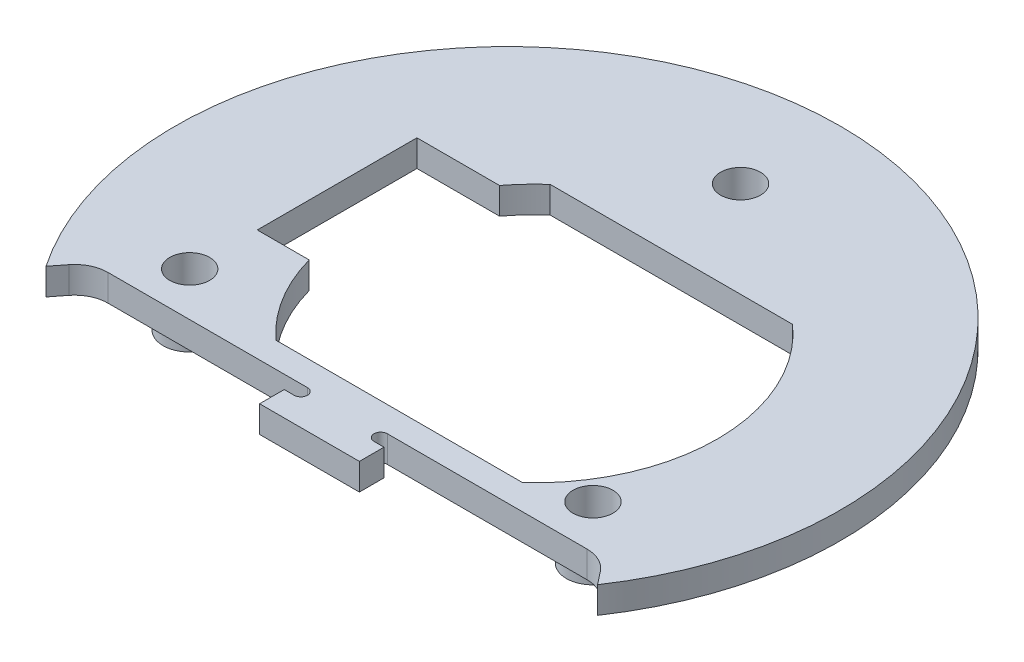
ISO-10303-21;
HEADER;
FILE_DESCRIPTION(('STEP AP214'),'2;1');
FILE_NAME('part.step','',(''),(''),'','','');
FILE_SCHEMA(('AUTOMOTIVE_DESIGN { 1 0 10303 214 1 1 1 1 }'));
ENDSEC;
DATA;
#1=APPLICATION_CONTEXT('core data for automotive mechanical design processes');
#2=APPLICATION_PROTOCOL_DEFINITION('international standard','automotive_design',2000,#1);
#3=PRODUCT_CONTEXT('',#1,'mechanical');
#4=PRODUCT('Part','Part','',(#3));
#5=PRODUCT_RELATED_PRODUCT_CATEGORY('part','',(#4));
#6=PRODUCT_DEFINITION_FORMATION('','',#4);
#7=PRODUCT_DEFINITION_CONTEXT('part definition',#1,'design');
#8=PRODUCT_DEFINITION('design','',#6,#7);
#9=PRODUCT_DEFINITION_SHAPE('','',#8);
#10=(LENGTH_UNIT() NAMED_UNIT(*) SI_UNIT(.MILLI.,.METRE.));
#11=(NAMED_UNIT(*) PLANE_ANGLE_UNIT() SI_UNIT($,.RADIAN.));
#12=(NAMED_UNIT(*) SI_UNIT($,.STERADIAN.) SOLID_ANGLE_UNIT());
#13=UNCERTAINTY_MEASURE_WITH_UNIT(LENGTH_MEASURE(1.E-05),#10,'distance_accuracy_value','');
#14=(GEOMETRIC_REPRESENTATION_CONTEXT(3) GLOBAL_UNCERTAINTY_ASSIGNED_CONTEXT((#13)) GLOBAL_UNIT_ASSIGNED_CONTEXT((#10,
#11,#12)) REPRESENTATION_CONTEXT('',''));
#15=CARTESIAN_POINT('',(0.,0.,0.));
#16=DIRECTION('',(0.,0.,1.));
#17=DIRECTION('',(1.,0.,0.));
#18=AXIS2_PLACEMENT_3D('',#15,#16,#17);
#19=CARTESIAN_POINT('',(0.,4.,0.));
#20=DIRECTION('',(0.,-1.,0.));
#21=DIRECTION('',(0.,0.,-1.));
#22=AXIS2_PLACEMENT_3D('',#19,#20,#21);
#23=CYLINDRICAL_SURFACE('',#22,50.);
#24=DIRECTION('',(0.,-1.,0.));
#25=VECTOR('',#24,1.);
#26=CARTESIAN_POINT('',(-41.4552503209535,4.,27.9546457825364));
#27=LINE('',#26,#25);
#28=CARTESIAN_POINT('',(-41.4552503209535,4.,27.9546457825364));
#29=VERTEX_POINT('',#28);
#30=CARTESIAN_POINT('',(-41.4552503209535,0.,27.9546457825364));
#31=VERTEX_POINT('',#30);
#32=EDGE_CURVE('E321',#29,#31,#27,.T.);
#33=ORIENTED_EDGE('',*,*,#32,.F.);
#34=CARTESIAN_POINT('',(0.,4.,0.));
#35=DIRECTION('',(0.,1.,0.));
#36=DIRECTION('',(0.,0.,1.));
#37=AXIS2_PLACEMENT_3D('',#34,#35,#36);
#38=CIRCLE('',#37,50.);
#39=CARTESIAN_POINT('',(41.4552503209535,4.,27.9546457825364));
#40=VERTEX_POINT('',#39);
#41=EDGE_CURVE('E354',#40,#29,#38,.T.);
#42=ORIENTED_EDGE('',*,*,#41,.F.);
#43=DIRECTION('',(0.,-1.,0.));
#44=VECTOR('',#43,1.);
#45=CARTESIAN_POINT('',(41.4552503209535,4.,27.9546457825364));
#46=LINE('',#45,#44);
#47=CARTESIAN_POINT('',(41.4552503209535,0.,27.9546457825364));
#48=VERTEX_POINT('',#47);
#49=EDGE_CURVE('E318',#40,#48,#46,.T.);
#50=ORIENTED_EDGE('',*,*,#49,.T.);
#51=CARTESIAN_POINT('',(0.,0.,0.));
#52=DIRECTION('',(0.,1.,0.));
#53=DIRECTION('',(0.,0.,1.));
#54=AXIS2_PLACEMENT_3D('',#51,#52,#53);
#55=CIRCLE('',#54,50.);
#56=EDGE_CURVE('E353',#48,#31,#55,.T.);
#57=ORIENTED_EDGE('',*,*,#56,.T.);
#58=EDGE_LOOP('',(#33,#42,#50,#57));
#59=FACE_BOUND('',#58,.T.);
#60=ADVANCED_FACE('F34',(#59),#23,.T.);
#61=CARTESIAN_POINT('',(0.,4.,0.));
#62=DIRECTION('',(0.,1.,0.));
#63=DIRECTION('',(0.,0.,1.));
#64=AXIS2_PLACEMENT_3D('',#61,#62,#63);
#65=PLANE('',#64);
#66=DIRECTION('',(1.,0.,0.));
#67=VECTOR('',#66,1.);
#68=CARTESIAN_POINT('',(0.,4.,7.35));
#69=LINE('',#68,#67);
#70=CARTESIAN_POINT('',(-30.3,4.,7.35));
#71=VERTEX_POINT('',#70);
#72=CARTESIAN_POINT('',(-22.4995754682976,4.,7.35));
#73=VERTEX_POINT('',#72);
#74=EDGE_CURVE('E48',#71,#73,#69,.T.);
#75=ORIENTED_EDGE('',*,*,#74,.F.);
#76=DIRECTION('',(0.,0.,-1.));
#77=VECTOR('',#76,1.);
#78=CARTESIAN_POINT('',(-30.3,4.,0.));
#79=LINE('',#78,#77);
#80=CARTESIAN_POINT('',(-30.3,4.,-16.65));
#81=VERTEX_POINT('',#80);
#82=EDGE_CURVE('E215',#71,#81,#79,.T.);
#83=ORIENTED_EDGE('',*,*,#82,.T.);
#84=DIRECTION('',(1.,0.,0.));
#85=VECTOR('',#84,1.);
#86=CARTESIAN_POINT('',(0.,4.,-16.65));
#87=LINE('',#86,#85);
#88=CARTESIAN_POINT('',(-17.8866968727581,4.,-16.65));
#89=VERTEX_POINT('',#88);
#90=EDGE_CURVE('E212',#81,#89,#87,.T.);
#91=ORIENTED_EDGE('',*,*,#90,.T.);
#92=CARTESIAN_POINT('',(4.,4.,0.));
#93=DIRECTION('',(0.,1.,0.));
#94=DIRECTION('',(0.,0.,1.));
#95=AXIS2_PLACEMENT_3D('',#92,#93,#94);
#96=CIRCLE('',#95,27.5);
#97=CARTESIAN_POINT('',(-14.2178483910697,4.,-20.6));
#98=VERTEX_POINT('',#97);
#99=EDGE_CURVE('E209',#98,#89,#96,.T.);
#100=ORIENTED_EDGE('',*,*,#99,.F.);
#101=DIRECTION('',(1.,0.,0.));
#102=VECTOR('',#101,1.);
#103=CARTESIAN_POINT('',(0.,4.,-20.6));
#104=LINE('',#103,#102);
#105=CARTESIAN_POINT('',(22.2178483910697,4.,-20.6));
#106=VERTEX_POINT('',#105);
#107=EDGE_CURVE('E204',#98,#106,#104,.T.);
#108=ORIENTED_EDGE('',*,*,#107,.T.);
#109=CARTESIAN_POINT('',(4.,4.,0.));
#110=DIRECTION('',(0.,1.,0.));
#111=DIRECTION('',(0.,0.,1.));
#112=AXIS2_PLACEMENT_3D('',#109,#110,#111);
#113=CIRCLE('',#112,27.5);
#114=CARTESIAN_POINT('',(22.5515498004884,4.,20.3));
#115=VERTEX_POINT('',#114);
#116=EDGE_CURVE('E202',#115,#106,#113,.T.);
#117=ORIENTED_EDGE('',*,*,#116,.F.);
#118=DIRECTION('',(-1.,0.,0.));
#119=VECTOR('',#118,1.);
#120=CARTESIAN_POINT('',(0.,4.,20.3));
#121=LINE('',#120,#119);
#122=CARTESIAN_POINT('',(-14.5515498004884,4.,20.3));
#123=VERTEX_POINT('',#122);
#124=EDGE_CURVE('E185',#115,#123,#121,.T.);
#125=ORIENTED_EDGE('',*,*,#124,.T.);
#126=CARTESIAN_POINT('',(4.,4.,0.));
#127=DIRECTION('',(0.,1.,0.));
#128=DIRECTION('',(0.,0.,1.));
#129=AXIS2_PLACEMENT_3D('',#126,#127,#128);
#130=CIRCLE('',#129,27.5);
#131=EDGE_CURVE('E194',#73,#123,#130,.T.);
#132=ORIENTED_EDGE('',*,*,#131,.F.);
#133=EDGE_LOOP('',(#75,#83,#91,#100,#108,#117,#125,#132));
#134=FACE_BOUND('',#133,.T.);
#135=CARTESIAN_POINT('',(30.3108891324553,4.,17.5000000000001));
#136=DIRECTION('',(0.,1.,0.));
#137=DIRECTION('',(-0.866025403784436,0.,-0.500000000000004));
#138=AXIS2_PLACEMENT_3D('',#135,#136,#137);
#139=CIRCLE('',#138,3.);
#140=CARTESIAN_POINT('',(27.712812921102,4.,16.0000000000001));
#141=VERTEX_POINT('',#140);
#142=EDGE_CURVE('E345',#141,#141,#139,.T.);
#143=ORIENTED_EDGE('',*,*,#142,.F.);
#144=EDGE_LOOP('',(#143));
#145=FACE_BOUND('',#144,.T.);
#146=CARTESIAN_POINT('',(-30.3108891324555,4.,17.4999999999997));
#147=DIRECTION('',(0.,1.,0.));
#148=DIRECTION('',(0.866025403784443,0.,-0.499999999999992));
#149=AXIS2_PLACEMENT_3D('',#146,#147,#148);
#150=CIRCLE('',#149,3.);
#151=CARTESIAN_POINT('',(-27.7128129211022,4.,15.9999999999997));
#152=VERTEX_POINT('',#151);
#153=EDGE_CURVE('E344',#152,#152,#150,.T.);
#154=ORIENTED_EDGE('',*,*,#153,.F.);
#155=EDGE_LOOP('',(#154));
#156=FACE_BOUND('',#155,.T.);
#157=CARTESIAN_POINT('',(0.,4.,-35.));
#158=DIRECTION('',(0.,1.,0.));
#159=DIRECTION('',(0.,0.,1.));
#160=AXIS2_PLACEMENT_3D('',#157,#158,#159);
#161=CIRCLE('',#160,3.);
#162=CARTESIAN_POINT('',(0.,4.,-32.));
#163=VERTEX_POINT('',#162);
#164=EDGE_CURVE('E348',#163,#163,#161,.T.);
#165=ORIENTED_EDGE('',*,*,#164,.F.);
#166=EDGE_LOOP('',(#165));
#167=FACE_BOUND('',#166,.T.);
#168=ORIENTED_EDGE('',*,*,#41,.T.);
#169=DIRECTION('',(-0.616924801079032,0.,0.787022102493695));
#170=VECTOR('',#169,1.);
#171=CARTESIAN_POINT('',(-39.9351105124685,4.,26.0153759946049));
#172=LINE('',#171,#170);
#173=CARTESIAN_POINT('',(-39.9351105124685,4.,26.0153759946049));
#174=VERTEX_POINT('',#173);
#175=EDGE_CURVE('E233',#174,#29,#172,.T.);
#176=ORIENTED_EDGE('',*,*,#175,.F.);
#177=CARTESIAN_POINT('',(-36.,4.,29.1));
#178=DIRECTION('',(0.,1.,0.));
#179=DIRECTION('',(0.,0.,1.));
#180=AXIS2_PLACEMENT_3D('',#177,#178,#179);
#181=CIRCLE('',#180,5.);
#182=CARTESIAN_POINT('',(-36.,4.,24.1));
#183=VERTEX_POINT('',#182);
#184=EDGE_CURVE('E231',#183,#174,#181,.T.);
#185=ORIENTED_EDGE('',*,*,#184,.F.);
#186=DIRECTION('',(-1.,0.,0.));
#187=VECTOR('',#186,1.);
#188=CARTESIAN_POINT('',(-36.,4.,24.1));
#189=LINE('',#188,#187);
#190=CARTESIAN_POINT('',(-6.,4.,24.1));
#191=VERTEX_POINT('',#190);
#192=EDGE_CURVE('E256',#191,#183,#189,.T.);
#193=ORIENTED_EDGE('',*,*,#192,.F.);
#194=CARTESIAN_POINT('',(-6.,4.,25.1));
#195=DIRECTION('',(0.,1.,0.));
#196=DIRECTION('',(0.,0.,1.));
#197=AXIS2_PLACEMENT_3D('',#194,#195,#196);
#198=CIRCLE('',#197,1.);
#199=CARTESIAN_POINT('',(-6.,4.,26.1));
#200=VERTEX_POINT('',#199);
#201=EDGE_CURVE('E254',#200,#191,#198,.T.);
#202=ORIENTED_EDGE('',*,*,#201,.F.);
#203=DIRECTION('',(1.,0.,0.));
#204=VECTOR('',#203,1.);
#205=CARTESIAN_POINT('',(-6.,4.,26.1));
#206=LINE('',#205,#204);
#207=CARTESIAN_POINT('',(-7.5,4.,26.1));
#208=VERTEX_POINT('',#207);
#209=EDGE_CURVE('E252',#208,#200,#206,.T.);
#210=ORIENTED_EDGE('',*,*,#209,.F.);
#211=DIRECTION('',(0.,0.,-1.));
#212=VECTOR('',#211,1.);
#213=CARTESIAN_POINT('',(-7.5,4.,26.1));
#214=LINE('',#213,#212);
#215=CARTESIAN_POINT('',(-7.5,4.,29.8));
#216=VERTEX_POINT('',#215);
#217=EDGE_CURVE('E250',#216,#208,#214,.T.);
#218=ORIENTED_EDGE('',*,*,#217,.F.);
#219=DIRECTION('',(-1.,0.,0.));
#220=VECTOR('',#219,1.);
#221=CARTESIAN_POINT('',(-7.5,4.,29.8));
#222=LINE('',#221,#220);
#223=CARTESIAN_POINT('',(7.5,4.,29.8));
#224=VERTEX_POINT('',#223);
#225=EDGE_CURVE('E248',#224,#216,#222,.T.);
#226=ORIENTED_EDGE('',*,*,#225,.F.);
#227=DIRECTION('',(0.,0.,1.));
#228=VECTOR('',#227,1.);
#229=CARTESIAN_POINT('',(7.5,4.,26.1));
#230=LINE('',#229,#228);
#231=CARTESIAN_POINT('',(7.5,4.,26.1));
#232=VERTEX_POINT('',#231);
#233=EDGE_CURVE('E246',#232,#224,#230,.T.);
#234=ORIENTED_EDGE('',*,*,#233,.F.);
#235=DIRECTION('',(1.,0.,0.));
#236=VECTOR('',#235,1.);
#237=CARTESIAN_POINT('',(6.,4.,26.1));
#238=LINE('',#237,#236);
#239=CARTESIAN_POINT('',(6.,4.,26.1));
#240=VERTEX_POINT('',#239);
#241=EDGE_CURVE('E244',#240,#232,#238,.T.);
#242=ORIENTED_EDGE('',*,*,#241,.F.);
#243=CARTESIAN_POINT('',(6.,4.,25.1));
#244=DIRECTION('',(0.,1.,0.));
#245=DIRECTION('',(0.,0.,-1.));
#246=AXIS2_PLACEMENT_3D('',#243,#244,#245);
#247=CIRCLE('',#246,1.);
#248=CARTESIAN_POINT('',(6.,4.,24.1));
#249=VERTEX_POINT('',#248);
#250=EDGE_CURVE('E242',#249,#240,#247,.T.);
#251=ORIENTED_EDGE('',*,*,#250,.F.);
#252=DIRECTION('',(-1.,0.,0.));
#253=VECTOR('',#252,1.);
#254=CARTESIAN_POINT('',(36.,4.,24.1));
#255=LINE('',#254,#253);
#256=CARTESIAN_POINT('',(36.,4.,24.1));
#257=VERTEX_POINT('',#256);
#258=EDGE_CURVE('E240',#257,#249,#255,.T.);
#259=ORIENTED_EDGE('',*,*,#258,.F.);
#260=CARTESIAN_POINT('',(36.,4.,29.1));
#261=DIRECTION('',(0.,1.,0.));
#262=DIRECTION('',(0.,0.,-1.));
#263=AXIS2_PLACEMENT_3D('',#260,#261,#262);
#264=CIRCLE('',#263,5.);
#265=CARTESIAN_POINT('',(39.9351105124685,4.,26.0153759946048));
#266=VERTEX_POINT('',#265);
#267=EDGE_CURVE('E238',#266,#257,#264,.T.);
#268=ORIENTED_EDGE('',*,*,#267,.F.);
#269=DIRECTION('',(-0.616924801079032,0.,-0.787022102493695));
#270=VECTOR('',#269,1.);
#271=CARTESIAN_POINT('',(39.9351105124685,4.,26.0153759946049));
#272=LINE('',#271,#270);
#273=EDGE_CURVE('E236',#40,#266,#272,.T.);
#274=ORIENTED_EDGE('',*,*,#273,.F.);
#275=EDGE_LOOP('',(#168,#176,#185,#193,#202,#210,#218,#226,#234,#242,#251,#259,#268,#274));
#276=FACE_BOUND('',#275,.T.);
#277=ADVANCED_FACE('F198',(#134,#145,#156,#167,#276),#65,.T.);
#278=CARTESIAN_POINT('',(0.,0.,0.));
#279=DIRECTION('',(0.,1.,0.));
#280=DIRECTION('',(0.,0.,1.));
#281=AXIS2_PLACEMENT_3D('',#278,#279,#280);
#282=PLANE('',#281);
#283=DIRECTION('',(0.,0.,-1.));
#284=VECTOR('',#283,1.);
#285=CARTESIAN_POINT('',(-30.3,0.,0.));
#286=LINE('',#285,#284);
#287=CARTESIAN_POINT('',(-30.3,0.,7.35));
#288=VERTEX_POINT('',#287);
#289=CARTESIAN_POINT('',(-30.3,0.,-16.65));
#290=VERTEX_POINT('',#289);
#291=EDGE_CURVE('E41',#288,#290,#286,.T.);
#292=ORIENTED_EDGE('',*,*,#291,.F.);
#293=DIRECTION('',(1.,0.,0.));
#294=VECTOR('',#293,1.);
#295=CARTESIAN_POINT('',(0.,0.,7.35));
#296=LINE('',#295,#294);
#297=CARTESIAN_POINT('',(-22.4995754682976,0.,7.35));
#298=VERTEX_POINT('',#297);
#299=EDGE_CURVE('E11',#288,#298,#296,.T.);
#300=ORIENTED_EDGE('',*,*,#299,.T.);
#301=CARTESIAN_POINT('',(4.,0.,0.));
#302=DIRECTION('',(0.,1.,0.));
#303=DIRECTION('',(0.,0.,1.));
#304=AXIS2_PLACEMENT_3D('',#301,#302,#303);
#305=CIRCLE('',#304,27.5);
#306=CARTESIAN_POINT('',(-14.5515498004884,0.,20.3));
#307=VERTEX_POINT('',#306);
#308=EDGE_CURVE('E368',#298,#307,#305,.T.);
#309=ORIENTED_EDGE('',*,*,#308,.T.);
#310=DIRECTION('',(-1.,0.,0.));
#311=VECTOR('',#310,1.);
#312=CARTESIAN_POINT('',(0.,0.,20.3));
#313=LINE('',#312,#311);
#314=CARTESIAN_POINT('',(22.5515498004884,0.,20.3));
#315=VERTEX_POINT('',#314);
#316=EDGE_CURVE('E188',#315,#307,#313,.T.);
#317=ORIENTED_EDGE('',*,*,#316,.F.);
#318=CARTESIAN_POINT('',(4.,0.,0.));
#319=DIRECTION('',(0.,1.,0.));
#320=DIRECTION('',(0.,0.,1.));
#321=AXIS2_PLACEMENT_3D('',#318,#319,#320);
#322=CIRCLE('',#321,27.5);
#323=CARTESIAN_POINT('',(22.2178483910697,0.,-20.6));
#324=VERTEX_POINT('',#323);
#325=EDGE_CURVE('E371',#315,#324,#322,.T.);
#326=ORIENTED_EDGE('',*,*,#325,.T.);
#327=DIRECTION('',(1.,0.,0.));
#328=VECTOR('',#327,1.);
#329=CARTESIAN_POINT('',(0.,0.,-20.6));
#330=LINE('',#329,#328);
#331=CARTESIAN_POINT('',(-14.2178483910697,0.,-20.6));
#332=VERTEX_POINT('',#331);
#333=EDGE_CURVE('E374',#332,#324,#330,.T.);
#334=ORIENTED_EDGE('',*,*,#333,.F.);
#335=CARTESIAN_POINT('',(4.,0.,0.));
#336=DIRECTION('',(0.,1.,0.));
#337=DIRECTION('',(0.,0.,1.));
#338=AXIS2_PLACEMENT_3D('',#335,#336,#337);
#339=CIRCLE('',#338,27.5);
#340=CARTESIAN_POINT('',(-17.8866968727581,0.,-16.65));
#341=VERTEX_POINT('',#340);
#342=EDGE_CURVE('E376',#332,#341,#339,.T.);
#343=ORIENTED_EDGE('',*,*,#342,.T.);
#344=DIRECTION('',(1.,0.,0.));
#345=VECTOR('',#344,1.);
#346=CARTESIAN_POINT('',(0.,0.,-16.65));
#347=LINE('',#346,#345);
#348=EDGE_CURVE('E379',#290,#341,#347,.T.);
#349=ORIENTED_EDGE('',*,*,#348,.F.);
#350=EDGE_LOOP('',(#292,#300,#309,#317,#326,#334,#343,#349));
#351=FACE_BOUND('',#350,.T.);
#352=CARTESIAN_POINT('',(0.,0.,-35.));
#353=DIRECTION('',(0.,1.,0.));
#354=DIRECTION('',(0.,0.,1.));
#355=AXIS2_PLACEMENT_3D('',#352,#353,#354);
#356=CIRCLE('',#355,4.);
#357=CARTESIAN_POINT('',(0.,0.,-31.));
#358=VERTEX_POINT('',#357);
#359=EDGE_CURVE('E357',#358,#358,#356,.F.);
#360=ORIENTED_EDGE('',*,*,#359,.F.);
#361=EDGE_LOOP('',(#360));
#362=FACE_BOUND('',#361,.T.);
#363=CARTESIAN_POINT('',(-30.3108891324553,0.,17.5000000000001));
#364=DIRECTION('',(0.,1.,0.));
#365=DIRECTION('',(0.,0.,1.));
#366=AXIS2_PLACEMENT_3D('',#363,#364,#365);
#367=CIRCLE('',#366,4.);
#368=CARTESIAN_POINT('',(-30.3108891324553,0.,21.5000000000001));
#369=VERTEX_POINT('',#368);
#370=EDGE_CURVE('E362',#369,#369,#367,.F.);
#371=ORIENTED_EDGE('',*,*,#370,.F.);
#372=EDGE_LOOP('',(#371));
#373=FACE_BOUND('',#372,.T.);
#374=CARTESIAN_POINT('',(30.3108891324555,0.,17.4999999999997));
#375=DIRECTION('',(0.,1.,0.));
#376=DIRECTION('',(0.,0.,1.));
#377=AXIS2_PLACEMENT_3D('',#374,#375,#376);
#378=CIRCLE('',#377,4.);
#379=CARTESIAN_POINT('',(30.3108891324555,0.,21.4999999999997));
#380=VERTEX_POINT('',#379);
#381=EDGE_CURVE('E365',#380,#380,#378,.F.);
#382=ORIENTED_EDGE('',*,*,#381,.F.);
#383=EDGE_LOOP('',(#382));
#384=FACE_BOUND('',#383,.T.);
#385=DIRECTION('',(-0.616924801079032,0.,0.787022102493695));
#386=VECTOR('',#385,1.);
#387=CARTESIAN_POINT('',(-39.9351105124685,0.,26.0153759946049));
#388=LINE('',#387,#386);
#389=CARTESIAN_POINT('',(-39.9351105124685,0.,26.0153759946049));
#390=VERTEX_POINT('',#389);
#391=EDGE_CURVE('E261',#390,#31,#388,.T.);
#392=ORIENTED_EDGE('',*,*,#391,.T.);
#393=ORIENTED_EDGE('',*,*,#56,.F.);
#394=DIRECTION('',(-0.616924801079032,0.,-0.787022102493695));
#395=VECTOR('',#394,1.);
#396=CARTESIAN_POINT('',(39.9351105124685,0.,26.0153759946049));
#397=LINE('',#396,#395);
#398=CARTESIAN_POINT('',(39.9351105124685,0.,26.0153759946048));
#399=VERTEX_POINT('',#398);
#400=EDGE_CURVE('E264',#48,#399,#397,.T.);
#401=ORIENTED_EDGE('',*,*,#400,.T.);
#402=CARTESIAN_POINT('',(36.,0.,29.1));
#403=DIRECTION('',(0.,1.,0.));
#404=DIRECTION('',(0.,0.,-1.));
#405=AXIS2_PLACEMENT_3D('',#402,#403,#404);
#406=CIRCLE('',#405,5.);
#407=CARTESIAN_POINT('',(36.,0.,24.1));
#408=VERTEX_POINT('',#407);
#409=EDGE_CURVE('E267',#399,#408,#406,.T.);
#410=ORIENTED_EDGE('',*,*,#409,.T.);
#411=DIRECTION('',(-1.,0.,0.));
#412=VECTOR('',#411,1.);
#413=CARTESIAN_POINT('',(36.,0.,24.1));
#414=LINE('',#413,#412);
#415=CARTESIAN_POINT('',(6.,0.,24.1));
#416=VERTEX_POINT('',#415);
#417=EDGE_CURVE('E270',#408,#416,#414,.T.);
#418=ORIENTED_EDGE('',*,*,#417,.T.);
#419=CARTESIAN_POINT('',(6.,0.,25.1));
#420=DIRECTION('',(0.,1.,0.));
#421=DIRECTION('',(0.,0.,-1.));
#422=AXIS2_PLACEMENT_3D('',#419,#420,#421);
#423=CIRCLE('',#422,1.);
#424=CARTESIAN_POINT('',(6.,0.,26.1));
#425=VERTEX_POINT('',#424);
#426=EDGE_CURVE('E273',#416,#425,#423,.T.);
#427=ORIENTED_EDGE('',*,*,#426,.T.);
#428=DIRECTION('',(1.,0.,0.));
#429=VECTOR('',#428,1.);
#430=CARTESIAN_POINT('',(6.,0.,26.1));
#431=LINE('',#430,#429);
#432=CARTESIAN_POINT('',(7.5,0.,26.1));
#433=VERTEX_POINT('',#432);
#434=EDGE_CURVE('E276',#425,#433,#431,.T.);
#435=ORIENTED_EDGE('',*,*,#434,.T.);
#436=DIRECTION('',(0.,0.,1.));
#437=VECTOR('',#436,1.);
#438=CARTESIAN_POINT('',(7.5,0.,26.1));
#439=LINE('',#438,#437);
#440=CARTESIAN_POINT('',(7.5,0.,29.8));
#441=VERTEX_POINT('',#440);
#442=EDGE_CURVE('E279',#433,#441,#439,.T.);
#443=ORIENTED_EDGE('',*,*,#442,.T.);
#444=DIRECTION('',(-1.,0.,0.));
#445=VECTOR('',#444,1.);
#446=CARTESIAN_POINT('',(-7.5,0.,29.8));
#447=LINE('',#446,#445);
#448=CARTESIAN_POINT('',(-7.5,0.,29.8));
#449=VERTEX_POINT('',#448);
#450=EDGE_CURVE('E282',#441,#449,#447,.T.);
#451=ORIENTED_EDGE('',*,*,#450,.T.);
#452=DIRECTION('',(0.,0.,-1.));
#453=VECTOR('',#452,1.);
#454=CARTESIAN_POINT('',(-7.5,0.,26.1));
#455=LINE('',#454,#453);
#456=CARTESIAN_POINT('',(-7.5,0.,26.1));
#457=VERTEX_POINT('',#456);
#458=EDGE_CURVE('E285',#449,#457,#455,.T.);
#459=ORIENTED_EDGE('',*,*,#458,.T.);
#460=DIRECTION('',(1.,0.,0.));
#461=VECTOR('',#460,1.);
#462=CARTESIAN_POINT('',(-6.,0.,26.1));
#463=LINE('',#462,#461);
#464=CARTESIAN_POINT('',(-6.,0.,26.1));
#465=VERTEX_POINT('',#464);
#466=EDGE_CURVE('E288',#457,#465,#463,.T.);
#467=ORIENTED_EDGE('',*,*,#466,.T.);
#468=CARTESIAN_POINT('',(-6.,0.,25.1));
#469=DIRECTION('',(0.,1.,0.));
#470=DIRECTION('',(0.,0.,1.));
#471=AXIS2_PLACEMENT_3D('',#468,#469,#470);
#472=CIRCLE('',#471,1.);
#473=CARTESIAN_POINT('',(-6.,0.,24.1));
#474=VERTEX_POINT('',#473);
#475=EDGE_CURVE('E291',#465,#474,#472,.T.);
#476=ORIENTED_EDGE('',*,*,#475,.T.);
#477=DIRECTION('',(-1.,0.,0.));
#478=VECTOR('',#477,1.);
#479=CARTESIAN_POINT('',(-36.,0.,24.1));
#480=LINE('',#479,#478);
#481=CARTESIAN_POINT('',(-36.,0.,24.1));
#482=VERTEX_POINT('',#481);
#483=EDGE_CURVE('E234',#474,#482,#480,.T.);
#484=ORIENTED_EDGE('',*,*,#483,.T.);
#485=CARTESIAN_POINT('',(-36.,0.,29.1));
#486=DIRECTION('',(0.,1.,0.));
#487=DIRECTION('',(0.,0.,1.));
#488=AXIS2_PLACEMENT_3D('',#485,#486,#487);
#489=CIRCLE('',#488,5.);
#490=EDGE_CURVE('E220',#482,#390,#489,.T.);
#491=ORIENTED_EDGE('',*,*,#490,.T.);
#492=EDGE_LOOP('',(#392,#393,#401,#410,#418,#427,#435,#443,#451,#459,#467,#476,#484,#491));
#493=FACE_BOUND('',#492,.T.);
#494=ADVANCED_FACE('F392',(#351,#362,#373,#384,#493),#282,.F.);
#495=CARTESIAN_POINT('',(0.,4.,-35.));
#496=DIRECTION('',(0.,-1.,0.));
#497=DIRECTION('',(0.,0.,-1.));
#498=AXIS2_PLACEMENT_3D('',#495,#496,#497);
#499=CYLINDRICAL_SURFACE('',#498,3.);
#500=ORIENTED_EDGE('',*,*,#164,.T.);
#501=EDGE_LOOP('',(#500));
#502=FACE_BOUND('',#501,.T.);
#503=CARTESIAN_POINT('',(0.,-4.,-35.));
#504=DIRECTION('',(0.,-1.,0.));
#505=DIRECTION('',(0.,0.,-1.));
#506=AXIS2_PLACEMENT_3D('',#503,#504,#505);
#507=CIRCLE('',#506,3.);
#508=CARTESIAN_POINT('',(0.,-4.,-38.));
#509=VERTEX_POINT('',#508);
#510=EDGE_CURVE('E338',#509,#509,#507,.T.);
#511=ORIENTED_EDGE('',*,*,#510,.T.);
#512=EDGE_LOOP('',(#511));
#513=FACE_BOUND('',#512,.T.);
#514=ADVANCED_FACE('F534',(#502,#513),#499,.F.);
#515=CARTESIAN_POINT('',(-30.3108891324555,4.,17.4999999999997));
#516=DIRECTION('',(0.,-1.,0.));
#517=DIRECTION('',(0.,0.,-1.));
#518=AXIS2_PLACEMENT_3D('',#515,#516,#517);
#519=CYLINDRICAL_SURFACE('',#518,3.);
#520=ORIENTED_EDGE('',*,*,#153,.T.);
#521=EDGE_LOOP('',(#520));
#522=FACE_BOUND('',#521,.T.);
#523=CARTESIAN_POINT('',(-30.3108891324553,-4.,17.5000000000001));
#524=DIRECTION('',(0.,-1.,0.));
#525=DIRECTION('',(-0.866025403784436,0.,0.500000000000004));
#526=AXIS2_PLACEMENT_3D('',#523,#524,#525);
#527=CIRCLE('',#526,3.);
#528=CARTESIAN_POINT('',(-32.9089653438086,-4.,19.0000000000002));
#529=VERTEX_POINT('',#528);
#530=EDGE_CURVE('E327',#529,#529,#527,.T.);
#531=ORIENTED_EDGE('',*,*,#530,.T.);
#532=EDGE_LOOP('',(#531));
#533=FACE_BOUND('',#532,.T.);
#534=ADVANCED_FACE('F530',(#522,#533),#519,.F.);
#535=CARTESIAN_POINT('',(30.3108891324553,4.,17.5000000000001));
#536=DIRECTION('',(0.,-1.,0.));
#537=DIRECTION('',(0.,0.,-1.));
#538=AXIS2_PLACEMENT_3D('',#535,#536,#537);
#539=CYLINDRICAL_SURFACE('',#538,3.);
#540=ORIENTED_EDGE('',*,*,#142,.T.);
#541=EDGE_LOOP('',(#540));
#542=FACE_BOUND('',#541,.T.);
#543=CARTESIAN_POINT('',(30.3108891324555,-4.,17.4999999999997));
#544=DIRECTION('',(0.,-1.,0.));
#545=DIRECTION('',(0.866025403784443,0.,0.499999999999992));
#546=AXIS2_PLACEMENT_3D('',#543,#544,#545);
#547=CIRCLE('',#546,3.);
#548=CARTESIAN_POINT('',(32.9089653438088,-4.,18.9999999999997));
#549=VERTEX_POINT('',#548);
#550=EDGE_CURVE('E326',#549,#549,#547,.T.);
#551=ORIENTED_EDGE('',*,*,#550,.T.);
#552=EDGE_LOOP('',(#551));
#553=FACE_BOUND('',#552,.T.);
#554=ADVANCED_FACE('F526',(#542,#553),#539,.F.);
#555=CARTESIAN_POINT('',(0.,-4.,-35.));
#556=DIRECTION('',(0.,1.,0.));
#557=DIRECTION('',(0.,0.,1.));
#558=AXIS2_PLACEMENT_3D('',#555,#556,#557);
#559=CYLINDRICAL_SURFACE('',#558,4.);
#560=CARTESIAN_POINT('',(0.,-4.,-35.));
#561=DIRECTION('',(0.,-1.,0.));
#562=DIRECTION('',(0.,0.,-1.));
#563=AXIS2_PLACEMENT_3D('',#560,#561,#562);
#564=CIRCLE('',#563,4.);
#565=CARTESIAN_POINT('',(0.,-4.,-39.));
#566=VERTEX_POINT('',#565);
#567=EDGE_CURVE('E341',#566,#566,#564,.T.);
#568=ORIENTED_EDGE('',*,*,#567,.F.);
#569=EDGE_LOOP('',(#568));
#570=FACE_BOUND('',#569,.T.);
#571=ORIENTED_EDGE('',*,*,#359,.T.);
#572=EDGE_LOOP('',(#571));
#573=FACE_BOUND('',#572,.T.);
#574=ADVANCED_FACE('F522',(#570,#573),#559,.T.);
#575=CARTESIAN_POINT('',(0.,-4.,-35.));
#576=DIRECTION('',(0.,-1.,0.));
#577=DIRECTION('',(0.,0.,-1.));
#578=AXIS2_PLACEMENT_3D('',#575,#576,#577);
#579=PLANE('',#578);
#580=ORIENTED_EDGE('',*,*,#510,.F.);
#581=EDGE_LOOP('',(#580));
#582=FACE_BOUND('',#581,.T.);
#583=ORIENTED_EDGE('',*,*,#567,.T.);
#584=EDGE_LOOP('',(#583));
#585=FACE_BOUND('',#584,.T.);
#586=ADVANCED_FACE('F518',(#582,#585),#579,.T.);
#587=CARTESIAN_POINT('',(-30.3108891324553,-4.,17.5000000000001));
#588=DIRECTION('',(0.,1.,0.));
#589=DIRECTION('',(0.,0.,1.));
#590=AXIS2_PLACEMENT_3D('',#587,#588,#589);
#591=CYLINDRICAL_SURFACE('',#590,4.);
#592=CARTESIAN_POINT('',(-30.3108891324553,-4.,17.5000000000001));
#593=DIRECTION('',(0.,-1.,0.));
#594=DIRECTION('',(-0.866025403784436,0.,0.500000000000004));
#595=AXIS2_PLACEMENT_3D('',#592,#593,#594);
#596=CIRCLE('',#595,4.);
#597=CARTESIAN_POINT('',(-33.774990747593,-4.,19.5000000000002));
#598=VERTEX_POINT('',#597);
#599=EDGE_CURVE('E335',#598,#598,#596,.T.);
#600=ORIENTED_EDGE('',*,*,#599,.F.);
#601=EDGE_LOOP('',(#600));
#602=FACE_BOUND('',#601,.T.);
#603=ORIENTED_EDGE('',*,*,#370,.T.);
#604=EDGE_LOOP('',(#603));
#605=FACE_BOUND('',#604,.T.);
#606=ADVANCED_FACE('F514',(#602,#605),#591,.T.);
#607=CARTESIAN_POINT('',(-30.3108891324553,-4.,17.5000000000001));
#608=DIRECTION('',(0.,-1.,0.));
#609=DIRECTION('',(-0.866025403784436,0.,0.500000000000004));
#610=AXIS2_PLACEMENT_3D('',#607,#608,#609);
#611=PLANE('',#610);
#612=ORIENTED_EDGE('',*,*,#530,.F.);
#613=EDGE_LOOP('',(#612));
#614=FACE_BOUND('',#613,.T.);
#615=ORIENTED_EDGE('',*,*,#599,.T.);
#616=EDGE_LOOP('',(#615));
#617=FACE_BOUND('',#616,.T.);
#618=ADVANCED_FACE('F510',(#614,#617),#611,.T.);
#619=CARTESIAN_POINT('',(30.3108891324555,-4.,17.4999999999997));
#620=DIRECTION('',(0.,1.,0.));
#621=DIRECTION('',(0.,0.,1.));
#622=AXIS2_PLACEMENT_3D('',#619,#620,#621);
#623=CYLINDRICAL_SURFACE('',#622,4.);
#624=CARTESIAN_POINT('',(30.3108891324555,-4.,17.4999999999997));
#625=DIRECTION('',(0.,-1.,0.));
#626=DIRECTION('',(0.866025403784443,0.,0.499999999999992));
#627=AXIS2_PLACEMENT_3D('',#624,#625,#626);
#628=CIRCLE('',#627,4.);
#629=CARTESIAN_POINT('',(33.7749907475933,-4.,19.4999999999997));
#630=VERTEX_POINT('',#629);
#631=EDGE_CURVE('E330',#630,#630,#628,.T.);
#632=ORIENTED_EDGE('',*,*,#631,.F.);
#633=EDGE_LOOP('',(#632));
#634=FACE_BOUND('',#633,.T.);
#635=ORIENTED_EDGE('',*,*,#381,.T.);
#636=EDGE_LOOP('',(#635));
#637=FACE_BOUND('',#636,.T.);
#638=ADVANCED_FACE('F506',(#634,#637),#623,.T.);
#639=CARTESIAN_POINT('',(30.3108891324555,-4.,17.4999999999997));
#640=DIRECTION('',(0.,-1.,0.));
#641=DIRECTION('',(0.866025403784443,0.,0.499999999999992));
#642=AXIS2_PLACEMENT_3D('',#639,#640,#641);
#643=PLANE('',#642);
#644=ORIENTED_EDGE('',*,*,#550,.F.);
#645=EDGE_LOOP('',(#644));
#646=FACE_BOUND('',#645,.T.);
#647=ORIENTED_EDGE('',*,*,#631,.T.);
#648=EDGE_LOOP('',(#647));
#649=FACE_BOUND('',#648,.T.);
#650=ADVANCED_FACE('F503',(#646,#649),#643,.T.);
#651=CARTESIAN_POINT('',(-36.,4.,29.1));
#652=DIRECTION('',(0.,-1.,0.));
#653=DIRECTION('',(0.,0.,-1.));
#654=AXIS2_PLACEMENT_3D('',#651,#652,#653);
#655=CYLINDRICAL_SURFACE('',#654,5.);
#656=ORIENTED_EDGE('',*,*,#490,.F.);
#657=DIRECTION('',(0.,-1.,0.));
#658=VECTOR('',#657,1.);
#659=CARTESIAN_POINT('',(-36.,4.,24.1));
#660=LINE('',#659,#658);
#661=EDGE_CURVE('E258',#183,#482,#660,.T.);
#662=ORIENTED_EDGE('',*,*,#661,.F.);
#663=ORIENTED_EDGE('',*,*,#184,.T.);
#664=DIRECTION('',(0.,-1.,0.));
#665=VECTOR('',#664,1.);
#666=CARTESIAN_POINT('',(-39.9351105124685,4.,26.0153759946049));
#667=LINE('',#666,#665);
#668=EDGE_CURVE('E323',#174,#390,#667,.T.);
#669=ORIENTED_EDGE('',*,*,#668,.T.);
#670=EDGE_LOOP('',(#656,#662,#663,#669));
#671=FACE_BOUND('',#670,.T.);
#672=ADVANCED_FACE('F446',(#671),#655,.F.);
#673=CARTESIAN_POINT('',(-39.9351105124685,4.,26.0153759946049));
#674=DIRECTION('',(0.787022102493695,0.,0.616924801079032));
#675=DIRECTION('',(0.616924801079032,0.,-0.787022102493695));
#676=AXIS2_PLACEMENT_3D('',#673,#674,#675);
#677=PLANE('',#676);
#678=ORIENTED_EDGE('',*,*,#391,.F.);
#679=ORIENTED_EDGE('',*,*,#668,.F.);
#680=ORIENTED_EDGE('',*,*,#175,.T.);
#681=ORIENTED_EDGE('',*,*,#32,.T.);
#682=EDGE_LOOP('',(#678,#679,#680,#681));
#683=FACE_BOUND('',#682,.T.);
#684=ADVANCED_FACE('F444',(#683),#677,.T.);
#685=CARTESIAN_POINT('',(39.9351105124685,4.,26.0153759946049));
#686=DIRECTION('',(-0.787022102493695,0.,0.616924801079032));
#687=DIRECTION('',(0.616924801079032,0.,0.787022102493695));
#688=AXIS2_PLACEMENT_3D('',#685,#686,#687);
#689=PLANE('',#688);
#690=ORIENTED_EDGE('',*,*,#400,.F.);
#691=ORIENTED_EDGE('',*,*,#49,.F.);
#692=ORIENTED_EDGE('',*,*,#273,.T.);
#693=DIRECTION('',(0.,-1.,0.));
#694=VECTOR('',#693,1.);
#695=CARTESIAN_POINT('',(39.9351105124685,4.,26.0153759946048));
#696=LINE('',#695,#694);
#697=EDGE_CURVE('E316',#266,#399,#696,.T.);
#698=ORIENTED_EDGE('',*,*,#697,.T.);
#699=EDGE_LOOP('',(#690,#691,#692,#698));
#700=FACE_BOUND('',#699,.T.);
#701=ADVANCED_FACE('F436',(#700),#689,.T.);
#702=CARTESIAN_POINT('',(36.,4.,29.1));
#703=DIRECTION('',(0.,-1.,0.));
#704=DIRECTION('',(0.,0.,-1.));
#705=AXIS2_PLACEMENT_3D('',#702,#703,#704);
#706=CYLINDRICAL_SURFACE('',#705,5.);
#707=ORIENTED_EDGE('',*,*,#409,.F.);
#708=ORIENTED_EDGE('',*,*,#697,.F.);
#709=ORIENTED_EDGE('',*,*,#267,.T.);
#710=DIRECTION('',(0.,-1.,0.));
#711=VECTOR('',#710,1.);
#712=CARTESIAN_POINT('',(36.,4.,24.1));
#713=LINE('',#712,#711);
#714=EDGE_CURVE('E314',#257,#408,#713,.T.);
#715=ORIENTED_EDGE('',*,*,#714,.T.);
#716=EDGE_LOOP('',(#707,#708,#709,#715));
#717=FACE_BOUND('',#716,.T.);
#718=ADVANCED_FACE('F439',(#717),#706,.F.);
#719=CARTESIAN_POINT('',(36.,4.,24.1));
#720=DIRECTION('',(0.,0.,1.));
#721=DIRECTION('',(1.,0.,0.));
#722=AXIS2_PLACEMENT_3D('',#719,#720,#721);
#723=PLANE('',#722);
#724=ORIENTED_EDGE('',*,*,#417,.F.);
#725=ORIENTED_EDGE('',*,*,#714,.F.);
#726=ORIENTED_EDGE('',*,*,#258,.T.);
#727=DIRECTION('',(0.,-1.,0.));
#728=VECTOR('',#727,1.);
#729=CARTESIAN_POINT('',(6.,4.,24.1));
#730=LINE('',#729,#728);
#731=EDGE_CURVE('E312',#249,#416,#730,.T.);
#732=ORIENTED_EDGE('',*,*,#731,.T.);
#733=EDGE_LOOP('',(#724,#725,#726,#732));
#734=FACE_BOUND('',#733,.T.);
#735=ADVANCED_FACE('F486',(#734),#723,.T.);
#736=CARTESIAN_POINT('',(6.,4.,25.1));
#737=DIRECTION('',(0.,-1.,0.));
#738=DIRECTION('',(0.,0.,-1.));
#739=AXIS2_PLACEMENT_3D('',#736,#737,#738);
#740=CYLINDRICAL_SURFACE('',#739,1.);
#741=ORIENTED_EDGE('',*,*,#426,.F.);
#742=ORIENTED_EDGE('',*,*,#731,.F.);
#743=ORIENTED_EDGE('',*,*,#250,.T.);
#744=DIRECTION('',(0.,-1.,0.));
#745=VECTOR('',#744,1.);
#746=CARTESIAN_POINT('',(6.,4.,26.1));
#747=LINE('',#746,#745);
#748=EDGE_CURVE('E310',#240,#425,#747,.T.);
#749=ORIENTED_EDGE('',*,*,#748,.T.);
#750=EDGE_LOOP('',(#741,#742,#743,#749));
#751=FACE_BOUND('',#750,.T.);
#752=ADVANCED_FACE('F483',(#751),#740,.F.);
#753=CARTESIAN_POINT('',(6.,4.,26.1));
#754=DIRECTION('',(0.,0.,-1.));
#755=DIRECTION('',(-1.,0.,0.));
#756=AXIS2_PLACEMENT_3D('',#753,#754,#755);
#757=PLANE('',#756);
#758=ORIENTED_EDGE('',*,*,#434,.F.);
#759=ORIENTED_EDGE('',*,*,#748,.F.);
#760=ORIENTED_EDGE('',*,*,#241,.T.);
#761=DIRECTION('',(0.,-1.,0.));
#762=VECTOR('',#761,1.);
#763=CARTESIAN_POINT('',(7.5,4.,26.1));
#764=LINE('',#763,#762);
#765=EDGE_CURVE('E308',#232,#433,#764,.T.);
#766=ORIENTED_EDGE('',*,*,#765,.T.);
#767=EDGE_LOOP('',(#758,#759,#760,#766));
#768=FACE_BOUND('',#767,.T.);
#769=ADVANCED_FACE('F480',(#768),#757,.T.);
#770=CARTESIAN_POINT('',(7.5,4.,26.1));
#771=DIRECTION('',(1.,0.,0.));
#772=DIRECTION('',(0.,0.,-1.));
#773=AXIS2_PLACEMENT_3D('',#770,#771,#772);
#774=PLANE('',#773);
#775=ORIENTED_EDGE('',*,*,#442,.F.);
#776=ORIENTED_EDGE('',*,*,#765,.F.);
#777=ORIENTED_EDGE('',*,*,#233,.T.);
#778=DIRECTION('',(0.,-1.,0.));
#779=VECTOR('',#778,1.);
#780=CARTESIAN_POINT('',(7.5,4.,29.8));
#781=LINE('',#780,#779);
#782=EDGE_CURVE('E306',#224,#441,#781,.T.);
#783=ORIENTED_EDGE('',*,*,#782,.T.);
#784=EDGE_LOOP('',(#775,#776,#777,#783));
#785=FACE_BOUND('',#784,.T.);
#786=ADVANCED_FACE('F473',(#785),#774,.T.);
#787=CARTESIAN_POINT('',(-7.5,4.,29.8));
#788=DIRECTION('',(0.,0.,1.));
#789=DIRECTION('',(1.,0.,0.));
#790=AXIS2_PLACEMENT_3D('',#787,#788,#789);
#791=PLANE('',#790);
#792=ORIENTED_EDGE('',*,*,#450,.F.);
#793=ORIENTED_EDGE('',*,*,#782,.F.);
#794=ORIENTED_EDGE('',*,*,#225,.T.);
#795=DIRECTION('',(0.,-1.,0.));
#796=VECTOR('',#795,1.);
#797=CARTESIAN_POINT('',(-7.5,4.,29.8));
#798=LINE('',#797,#796);
#799=EDGE_CURVE('E304',#216,#449,#798,.T.);
#800=ORIENTED_EDGE('',*,*,#799,.T.);
#801=EDGE_LOOP('',(#792,#793,#794,#800));
#802=FACE_BOUND('',#801,.T.);
#803=ADVANCED_FACE('F469',(#802),#791,.T.);
#804=CARTESIAN_POINT('',(-7.5,4.,26.1));
#805=DIRECTION('',(-1.,0.,0.));
#806=DIRECTION('',(0.,0.,1.));
#807=AXIS2_PLACEMENT_3D('',#804,#805,#806);
#808=PLANE('',#807);
#809=ORIENTED_EDGE('',*,*,#458,.F.);
#810=ORIENTED_EDGE('',*,*,#799,.F.);
#811=ORIENTED_EDGE('',*,*,#217,.T.);
#812=DIRECTION('',(0.,-1.,0.));
#813=VECTOR('',#812,1.);
#814=CARTESIAN_POINT('',(-7.5,4.,26.1));
#815=LINE('',#814,#813);
#816=EDGE_CURVE('E302',#208,#457,#815,.T.);
#817=ORIENTED_EDGE('',*,*,#816,.T.);
#818=EDGE_LOOP('',(#809,#810,#811,#817));
#819=FACE_BOUND('',#818,.T.);
#820=ADVANCED_FACE('F466',(#819),#808,.T.);
#821=CARTESIAN_POINT('',(-6.,4.,26.1));
#822=DIRECTION('',(0.,0.,-1.));
#823=DIRECTION('',(-1.,0.,0.));
#824=AXIS2_PLACEMENT_3D('',#821,#822,#823);
#825=PLANE('',#824);
#826=ORIENTED_EDGE('',*,*,#466,.F.);
#827=ORIENTED_EDGE('',*,*,#816,.F.);
#828=ORIENTED_EDGE('',*,*,#209,.T.);
#829=DIRECTION('',(0.,-1.,0.));
#830=VECTOR('',#829,1.);
#831=CARTESIAN_POINT('',(-6.,4.,26.1));
#832=LINE('',#831,#830);
#833=EDGE_CURVE('E300',#200,#465,#832,.T.);
#834=ORIENTED_EDGE('',*,*,#833,.T.);
#835=EDGE_LOOP('',(#826,#827,#828,#834));
#836=FACE_BOUND('',#835,.T.);
#837=ADVANCED_FACE('F458',(#836),#825,.T.);
#838=CARTESIAN_POINT('',(-6.,4.,25.1));
#839=DIRECTION('',(0.,-1.,0.));
#840=DIRECTION('',(0.,0.,-1.));
#841=AXIS2_PLACEMENT_3D('',#838,#839,#840);
#842=CYLINDRICAL_SURFACE('',#841,1.);
#843=ORIENTED_EDGE('',*,*,#475,.F.);
#844=ORIENTED_EDGE('',*,*,#833,.F.);
#845=ORIENTED_EDGE('',*,*,#201,.T.);
#846=DIRECTION('',(0.,-1.,0.));
#847=VECTOR('',#846,1.);
#848=CARTESIAN_POINT('',(-6.,4.,24.1));
#849=LINE('',#848,#847);
#850=EDGE_CURVE('E298',#191,#474,#849,.T.);
#851=ORIENTED_EDGE('',*,*,#850,.T.);
#852=EDGE_LOOP('',(#843,#844,#845,#851));
#853=FACE_BOUND('',#852,.T.);
#854=ADVANCED_FACE('F414',(#853),#842,.F.);
#855=CARTESIAN_POINT('',(-36.,4.,24.1));
#856=DIRECTION('',(0.,0.,1.));
#857=DIRECTION('',(1.,0.,0.));
#858=AXIS2_PLACEMENT_3D('',#855,#856,#857);
#859=PLANE('',#858);
#860=ORIENTED_EDGE('',*,*,#483,.F.);
#861=ORIENTED_EDGE('',*,*,#850,.F.);
#862=ORIENTED_EDGE('',*,*,#192,.T.);
#863=ORIENTED_EDGE('',*,*,#661,.T.);
#864=EDGE_LOOP('',(#860,#861,#862,#863));
#865=FACE_BOUND('',#864,.T.);
#866=ADVANCED_FACE('F407',(#865),#859,.T.);
#867=CARTESIAN_POINT('',(0.,-4.,7.35));
#868=DIRECTION('',(0.,0.,1.));
#869=DIRECTION('',(1.,0.,0.));
#870=AXIS2_PLACEMENT_3D('',#867,#868,#869);
#871=PLANE('',#870);
#872=DIRECTION('',(0.,1.,0.));
#873=VECTOR('',#872,1.);
#874=CARTESIAN_POINT('',(-30.3,-4.,7.35));
#875=LINE('',#874,#873);
#876=EDGE_CURVE('E218',#288,#71,#875,.T.);
#877=ORIENTED_EDGE('',*,*,#876,.T.);
#878=ORIENTED_EDGE('',*,*,#74,.T.);
#879=DIRECTION('',(0.,1.,0.));
#880=VECTOR('',#879,1.);
#881=CARTESIAN_POINT('',(-22.4995754682976,-4.,7.35));
#882=LINE('',#881,#880);
#883=EDGE_CURVE('E191',#298,#73,#882,.T.);
#884=ORIENTED_EDGE('',*,*,#883,.F.);
#885=ORIENTED_EDGE('',*,*,#299,.F.);
#886=EDGE_LOOP('',(#877,#878,#884,#885));
#887=FACE_BOUND('',#886,.T.);
#888=ADVANCED_FACE('F405',(#887),#871,.F.);
#889=CARTESIAN_POINT('',(-30.3,-4.,0.));
#890=DIRECTION('',(1.,0.,0.));
#891=DIRECTION('',(0.,0.,-1.));
#892=AXIS2_PLACEMENT_3D('',#889,#890,#891);
#893=PLANE('',#892);
#894=ORIENTED_EDGE('',*,*,#291,.T.);
#895=DIRECTION('',(0.,1.,0.));
#896=VECTOR('',#895,1.);
#897=CARTESIAN_POINT('',(-30.3,-4.,-16.65));
#898=LINE('',#897,#896);
#899=EDGE_CURVE('E221',#290,#81,#898,.T.);
#900=ORIENTED_EDGE('',*,*,#899,.T.);
#901=ORIENTED_EDGE('',*,*,#82,.F.);
#902=ORIENTED_EDGE('',*,*,#876,.F.);
#903=EDGE_LOOP('',(#894,#900,#901,#902));
#904=FACE_BOUND('',#903,.T.);
#905=ADVANCED_FACE('F384',(#904),#893,.T.);
#906=CARTESIAN_POINT('',(0.,-4.,-16.65));
#907=DIRECTION('',(0.,0.,1.));
#908=DIRECTION('',(1.,0.,0.));
#909=AXIS2_PLACEMENT_3D('',#906,#907,#908);
#910=PLANE('',#909);
#911=ORIENTED_EDGE('',*,*,#348,.T.);
#912=DIRECTION('',(0.,1.,0.));
#913=VECTOR('',#912,1.);
#914=CARTESIAN_POINT('',(-17.8866968727581,-4.,-16.65));
#915=LINE('',#914,#913);
#916=EDGE_CURVE('E223',#341,#89,#915,.T.);
#917=ORIENTED_EDGE('',*,*,#916,.T.);
#918=ORIENTED_EDGE('',*,*,#90,.F.);
#919=ORIENTED_EDGE('',*,*,#899,.F.);
#920=EDGE_LOOP('',(#911,#917,#918,#919));
#921=FACE_BOUND('',#920,.T.);
#922=ADVANCED_FACE('F390',(#921),#910,.T.);
#923=CARTESIAN_POINT('',(4.,-4.,0.));
#924=DIRECTION('',(0.,1.,0.));
#925=DIRECTION('',(0.,0.,1.));
#926=AXIS2_PLACEMENT_3D('',#923,#924,#925);
#927=CYLINDRICAL_SURFACE('',#926,27.5);
#928=DIRECTION('',(0.,1.,0.));
#929=VECTOR('',#928,1.);
#930=CARTESIAN_POINT('',(-14.2178483910697,-4.,-20.6));
#931=LINE('',#930,#929);
#932=EDGE_CURVE('E225',#332,#98,#931,.T.);
#933=ORIENTED_EDGE('',*,*,#932,.T.);
#934=ORIENTED_EDGE('',*,*,#99,.T.);
#935=ORIENTED_EDGE('',*,*,#916,.F.);
#936=ORIENTED_EDGE('',*,*,#342,.F.);
#937=EDGE_LOOP('',(#933,#934,#935,#936));
#938=FACE_BOUND('',#937,.T.);
#939=ADVANCED_FACE('F397',(#938),#927,.F.);
#940=CARTESIAN_POINT('',(0.,-4.,-20.6));
#941=DIRECTION('',(0.,0.,1.));
#942=DIRECTION('',(1.,0.,0.));
#943=AXIS2_PLACEMENT_3D('',#940,#941,#942);
#944=PLANE('',#943);
#945=ORIENTED_EDGE('',*,*,#333,.T.);
#946=DIRECTION('',(0.,1.,0.));
#947=VECTOR('',#946,1.);
#948=CARTESIAN_POINT('',(22.2178483910697,-4.,-20.6));
#949=LINE('',#948,#947);
#950=EDGE_CURVE('E227',#324,#106,#949,.T.);
#951=ORIENTED_EDGE('',*,*,#950,.T.);
#952=ORIENTED_EDGE('',*,*,#107,.F.);
#953=ORIENTED_EDGE('',*,*,#932,.F.);
#954=EDGE_LOOP('',(#945,#951,#952,#953));
#955=FACE_BOUND('',#954,.T.);
#956=ADVANCED_FACE('F400',(#955),#944,.T.);
#957=CARTESIAN_POINT('',(4.,-4.,0.));
#958=DIRECTION('',(0.,1.,0.));
#959=DIRECTION('',(0.,0.,1.));
#960=AXIS2_PLACEMENT_3D('',#957,#958,#959);
#961=CYLINDRICAL_SURFACE('',#960,27.5);
#962=DIRECTION('',(0.,1.,0.));
#963=VECTOR('',#962,1.);
#964=CARTESIAN_POINT('',(22.5515498004884,-4.,20.3));
#965=LINE('',#964,#963);
#966=EDGE_CURVE('E190',#315,#115,#965,.T.);
#967=ORIENTED_EDGE('',*,*,#966,.T.);
#968=ORIENTED_EDGE('',*,*,#116,.T.);
#969=ORIENTED_EDGE('',*,*,#950,.F.);
#970=ORIENTED_EDGE('',*,*,#325,.F.);
#971=EDGE_LOOP('',(#967,#968,#969,#970));
#972=FACE_BOUND('',#971,.T.);
#973=ADVANCED_FACE('F404',(#972),#961,.F.);
#974=CARTESIAN_POINT('',(0.,-4.,20.3));
#975=DIRECTION('',(0.,0.,-1.));
#976=DIRECTION('',(-1.,0.,0.));
#977=AXIS2_PLACEMENT_3D('',#974,#975,#976);
#978=PLANE('',#977);
#979=ORIENTED_EDGE('',*,*,#316,.T.);
#980=DIRECTION('',(0.,1.,0.));
#981=VECTOR('',#980,1.);
#982=CARTESIAN_POINT('',(-14.5515498004884,-4.,20.3));
#983=LINE('',#982,#981);
#984=EDGE_CURVE('E56',#307,#123,#983,.T.);
#985=ORIENTED_EDGE('',*,*,#984,.T.);
#986=ORIENTED_EDGE('',*,*,#124,.F.);
#987=ORIENTED_EDGE('',*,*,#966,.F.);
#988=EDGE_LOOP('',(#979,#985,#986,#987));
#989=FACE_BOUND('',#988,.T.);
#990=ADVANCED_FACE('F182',(#989),#978,.T.);
#991=CARTESIAN_POINT('',(4.,-4.,0.));
#992=DIRECTION('',(0.,1.,0.));
#993=DIRECTION('',(0.,0.,1.));
#994=AXIS2_PLACEMENT_3D('',#991,#992,#993);
#995=CYLINDRICAL_SURFACE('',#994,27.5);
#996=ORIENTED_EDGE('',*,*,#883,.T.);
#997=ORIENTED_EDGE('',*,*,#131,.T.);
#998=ORIENTED_EDGE('',*,*,#984,.F.);
#999=ORIENTED_EDGE('',*,*,#308,.F.);
#1000=EDGE_LOOP('',(#996,#997,#998,#999));
#1001=FACE_BOUND('',#1000,.T.);
#1002=ADVANCED_FACE('F195',(#1001),#995,.F.);
#1003=CLOSED_SHELL('',(#60,#277,#494,#514,#534,#554,#574,#586,#606,#618,#638,#650,#672,#684,
#701,#718,#735,#752,#769,#786,#803,#820,#837,#854,#866,#888,#905,#922,#939,#956,#973,#990,#1002));
#1004=MANIFOLD_SOLID_BREP('B2',#1003);
#1005=ADVANCED_BREP_SHAPE_REPRESENTATION('',(#18,#1004),#14);
#1006=SHAPE_DEFINITION_REPRESENTATION(#9,#1005);
ENDSEC;
END-ISO-10303-21;
